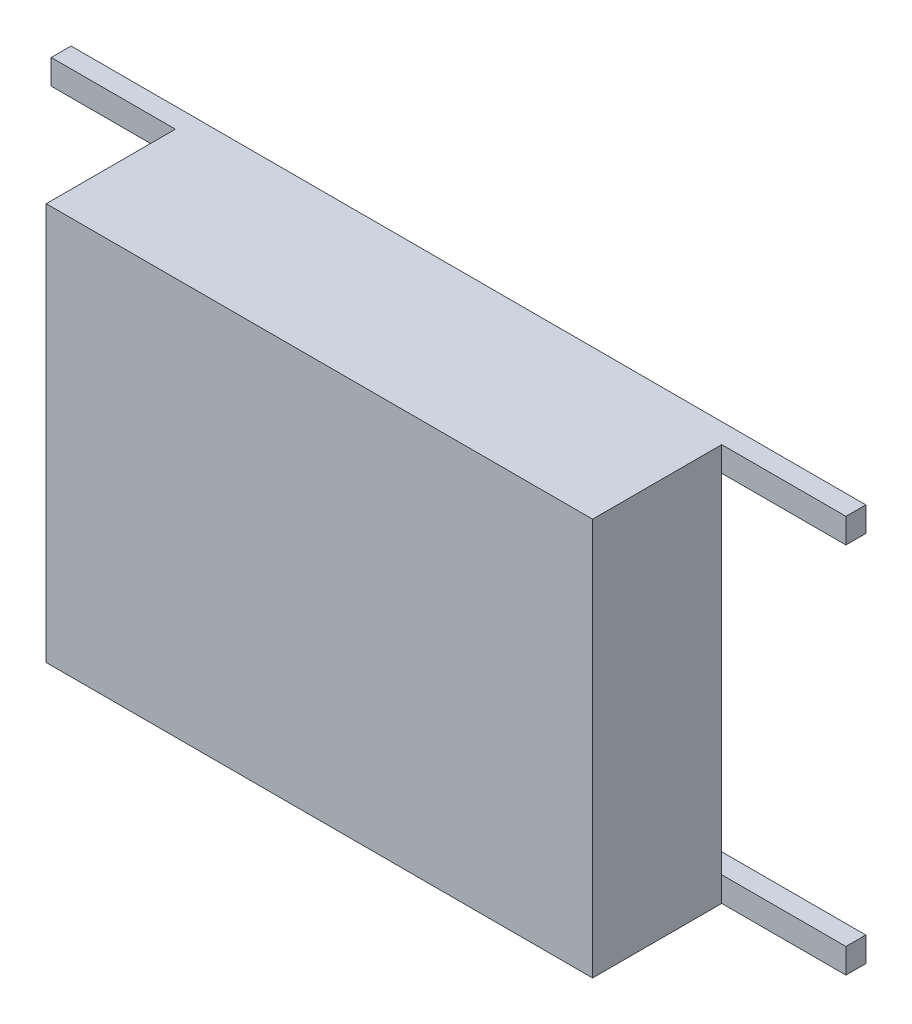
ISO-10303-21;
HEADER;
FILE_DESCRIPTION(('STEP AP214'),'2;1');
FILE_NAME('part.step','',(''),(''),'','','');
FILE_SCHEMA(('AUTOMOTIVE_DESIGN { 1 0 10303 214 1 1 1 1 }'));
ENDSEC;
DATA;
#1=APPLICATION_CONTEXT('core data for automotive mechanical design processes');
#2=APPLICATION_PROTOCOL_DEFINITION('international standard','automotive_design',2000,#1);
#3=PRODUCT_CONTEXT('',#1,'mechanical');
#4=PRODUCT('Part','Part','',(#3));
#5=PRODUCT_RELATED_PRODUCT_CATEGORY('part','',(#4));
#6=PRODUCT_DEFINITION_FORMATION('','',#4);
#7=PRODUCT_DEFINITION_CONTEXT('part definition',#1,'design');
#8=PRODUCT_DEFINITION('design','',#6,#7);
#9=PRODUCT_DEFINITION_SHAPE('','',#8);
#10=(LENGTH_UNIT() NAMED_UNIT(*) SI_UNIT(.MILLI.,.METRE.));
#11=(NAMED_UNIT(*) PLANE_ANGLE_UNIT() SI_UNIT($,.RADIAN.));
#12=(NAMED_UNIT(*) SI_UNIT($,.STERADIAN.) SOLID_ANGLE_UNIT());
#13=UNCERTAINTY_MEASURE_WITH_UNIT(LENGTH_MEASURE(1.E-05),#10,'distance_accuracy_value','');
#14=(GEOMETRIC_REPRESENTATION_CONTEXT(3) GLOBAL_UNCERTAINTY_ASSIGNED_CONTEXT((#13)) GLOBAL_UNIT_ASSIGNED_CONTEXT((#10,
#11,#12)) REPRESENTATION_CONTEXT('',''));
#15=CARTESIAN_POINT('',(0.,0.,0.));
#16=DIRECTION('',(0.,0.,1.));
#17=DIRECTION('',(1.,0.,0.));
#18=AXIS2_PLACEMENT_3D('',#15,#16,#17);
#19=CARTESIAN_POINT('',(0.15,-0.173205080757,0.02));
#20=DIRECTION('',(0.,0.,1.));
#21=DIRECTION('',(1.,0.,0.));
#22=AXIS2_PLACEMENT_3D('',#19,#20,#21);
#23=PLANE('',#22);
#24=DIRECTION('',(0.866025403784329,0.50000000000019,0.));
#25=VECTOR('',#24,1.);
#26=CARTESIAN_POINT('',(0.15,0.173205080757,0.02));
#27=LINE('',#26,#25);
#28=CARTESIAN_POINT('',(0.15,0.173205080757,0.02));
#29=VERTEX_POINT('',#28);
#30=CARTESIAN_POINT('',(-0.150000000000005,0.,0.02));
#31=VERTEX_POINT('',#30);
#32=EDGE_CURVE('E158',#29,#31,#27,.F.);
#33=ORIENTED_EDGE('',*,*,#32,.F.);
#34=DIRECTION('',(0.,1.,0.));
#35=VECTOR('',#34,1.);
#36=CARTESIAN_POINT('',(0.15,-0.173205080757,0.02));
#37=LINE('',#36,#35);
#38=CARTESIAN_POINT('',(0.150000000000003,-0.173205080756995,0.02));
#39=VERTEX_POINT('',#38);
#40=EDGE_CURVE('E162',#39,#29,#37,.T.);
#41=ORIENTED_EDGE('',*,*,#40,.F.);
#42=DIRECTION('',(-0.866025403784329,0.50000000000019,0.));
#43=VECTOR('',#42,1.);
#44=CARTESIAN_POINT('',(-0.15,0.,0.02));
#45=LINE('',#44,#43);
#46=EDGE_CURVE('E165',#31,#39,#45,.F.);
#47=ORIENTED_EDGE('',*,*,#46,.F.);
#48=EDGE_LOOP('',(#33,#41,#47));
#49=FACE_BOUND('',#48,.T.);
#50=ADVANCED_FACE('F17',(#49),#23,.F.);
#51=CARTESIAN_POINT('',(0.8,-0.35,0.04));
#52=DIRECTION('',(0.,-1.,0.));
#53=DIRECTION('',(1.,0.,0.));
#54=AXIS2_PLACEMENT_3D('',#51,#52,#53);
#55=PLANE('',#54);
#56=DIRECTION('',(0.,0.,1.));
#57=VECTOR('',#56,1.);
#58=CARTESIAN_POINT('',(0.35,-0.35,0.04));
#59=LINE('',#58,#57);
#60=CARTESIAN_POINT('',(0.35,-0.35,0.));
#61=VERTEX_POINT('',#60);
#62=CARTESIAN_POINT('',(0.35,-0.35,0.04));
#63=VERTEX_POINT('',#62);
#64=EDGE_CURVE('E20',#61,#63,#59,.T.);
#65=ORIENTED_EDGE('',*,*,#64,.T.);
#66=DIRECTION('',(-1.,0.,0.));
#67=VECTOR('',#66,1.);
#68=CARTESIAN_POINT('',(0.8,-0.35,0.04));
#69=LINE('',#68,#67);
#70=CARTESIAN_POINT('',(0.55,-0.35,0.04));
#71=VERTEX_POINT('',#70);
#72=EDGE_CURVE('E203',#71,#63,#69,.T.);
#73=ORIENTED_EDGE('',*,*,#72,.F.);
#74=DIRECTION('',(-1.,0.,0.));
#75=VECTOR('',#74,1.);
#76=CARTESIAN_POINT('',(0.8,-0.35,0.04));
#77=LINE('',#76,#75);
#78=CARTESIAN_POINT('',(0.8,-0.35,0.04));
#79=VERTEX_POINT('',#78);
#80=EDGE_CURVE('E196',#71,#79,#77,.F.);
#81=ORIENTED_EDGE('',*,*,#80,.T.);
#82=DIRECTION('',(0.,0.,1.));
#83=VECTOR('',#82,1.);
#84=CARTESIAN_POINT('',(0.8,-0.35,0.3));
#85=LINE('',#84,#83);
#86=CARTESIAN_POINT('',(0.8,-0.35,0.));
#87=VERTEX_POINT('',#86);
#88=EDGE_CURVE('E192',#79,#87,#85,.F.);
#89=ORIENTED_EDGE('',*,*,#88,.T.);
#90=DIRECTION('',(1.,0.,0.));
#91=VECTOR('',#90,1.);
#92=CARTESIAN_POINT('',(-0.8,-0.35,0.));
#93=LINE('',#92,#91);
#94=EDGE_CURVE('E216',#87,#61,#93,.F.);
#95=ORIENTED_EDGE('',*,*,#94,.T.);
#96=EDGE_LOOP('',(#65,#73,#81,#89,#95));
#97=FACE_BOUND('',#96,.T.);
#98=ADVANCED_FACE('F387',(#97),#55,.F.);
#99=CARTESIAN_POINT('',(0.35,-0.35,0.04));
#100=DIRECTION('',(-1.,0.,0.));
#101=DIRECTION('',(0.,0.,1.));
#102=AXIS2_PLACEMENT_3D('',#99,#100,#101);
#103=PLANE('',#102);
#104=DIRECTION('',(0.,0.,1.));
#105=VECTOR('',#104,1.);
#106=CARTESIAN_POINT('',(0.35,0.35,0.04));
#107=LINE('',#106,#105);
#108=CARTESIAN_POINT('',(0.35,0.35,0.));
#109=VERTEX_POINT('',#108);
#110=CARTESIAN_POINT('',(0.35,0.35,0.04));
#111=VERTEX_POINT('',#110);
#112=EDGE_CURVE('E184',#109,#111,#107,.T.);
#113=ORIENTED_EDGE('',*,*,#112,.T.);
#114=DIRECTION('',(0.,1.,0.));
#115=VECTOR('',#114,1.);
#116=CARTESIAN_POINT('',(0.35,-0.35,0.04));
#117=LINE('',#116,#115);
#118=EDGE_CURVE('E206',#63,#111,#117,.T.);
#119=ORIENTED_EDGE('',*,*,#118,.F.);
#120=ORIENTED_EDGE('',*,*,#64,.F.);
#121=DIRECTION('',(0.,1.,0.));
#122=VECTOR('',#121,1.);
#123=CARTESIAN_POINT('',(0.35,-0.4,0.));
#124=LINE('',#123,#122);
#125=EDGE_CURVE('E218',#61,#109,#124,.T.);
#126=ORIENTED_EDGE('',*,*,#125,.T.);
#127=EDGE_LOOP('',(#113,#119,#120,#126));
#128=FACE_BOUND('',#127,.T.);
#129=ADVANCED_FACE('F386',(#128),#103,.F.);
#130=CARTESIAN_POINT('',(0.15,0.173205080757,0.02));
#131=DIRECTION('',(0.50000000000019,-0.866025403784329,0.));
#132=DIRECTION('',(0.866025403784329,0.50000000000019,0.));
#133=AXIS2_PLACEMENT_3D('',#130,#131,#132);
#134=PLANE('',#133);
#135=ORIENTED_EDGE('',*,*,#32,.T.);
#136=DIRECTION('',(0.,0.,1.));
#137=VECTOR('',#136,1.);
#138=CARTESIAN_POINT('',(-0.15,0.,0.02));
#139=LINE('',#138,#137);
#140=CARTESIAN_POINT('',(-0.150000000000005,0.,0.));
#141=VERTEX_POINT('',#140);
#142=EDGE_CURVE('E174',#141,#31,#139,.T.);
#143=ORIENTED_EDGE('',*,*,#142,.F.);
#144=DIRECTION('',(0.866025403784298,0.500000000000243,0.));
#145=VECTOR('',#144,1.);
#146=CARTESIAN_POINT('',(-0.15,0.,0.));
#147=LINE('',#146,#145);
#148=CARTESIAN_POINT('',(0.15,0.173205080757,0.));
#149=VERTEX_POINT('',#148);
#150=EDGE_CURVE('E171',#141,#149,#147,.T.);
#151=ORIENTED_EDGE('',*,*,#150,.T.);
#152=DIRECTION('',(0.,0.,1.));
#153=VECTOR('',#152,1.);
#154=CARTESIAN_POINT('',(0.15,0.173205080757,0.02));
#155=LINE('',#154,#153);
#156=EDGE_CURVE('E168',#29,#149,#155,.F.);
#157=ORIENTED_EDGE('',*,*,#156,.F.);
#158=EDGE_LOOP('',(#135,#143,#151,#157));
#159=FACE_BOUND('',#158,.T.);
#160=ADVANCED_FACE('F169',(#159),#134,.T.);
#161=CARTESIAN_POINT('',(0.15,-0.173205080757,0.02));
#162=DIRECTION('',(-1.,0.,0.));
#163=DIRECTION('',(0.,0.,1.));
#164=AXIS2_PLACEMENT_3D('',#161,#162,#163);
#165=PLANE('',#164);
#166=ORIENTED_EDGE('',*,*,#40,.T.);
#167=ORIENTED_EDGE('',*,*,#156,.T.);
#168=DIRECTION('',(0.,1.,0.));
#169=VECTOR('',#168,1.);
#170=CARTESIAN_POINT('',(0.15,-0.4,0.));
#171=LINE('',#170,#169);
#172=CARTESIAN_POINT('',(0.150000000000003,-0.173205080756995,0.));
#173=VERTEX_POINT('',#172);
#174=EDGE_CURVE('E234',#149,#173,#171,.F.);
#175=ORIENTED_EDGE('',*,*,#174,.T.);
#176=DIRECTION('',(0.,0.,1.));
#177=VECTOR('',#176,1.);
#178=CARTESIAN_POINT('',(0.150000000000011,-0.173205080756982,0.02));
#179=LINE('',#178,#177);
#180=EDGE_CURVE('E178',#39,#173,#179,.F.);
#181=ORIENTED_EDGE('',*,*,#180,.F.);
#182=EDGE_LOOP('',(#166,#167,#175,#181));
#183=FACE_BOUND('',#182,.T.);
#184=ADVANCED_FACE('F176',(#183),#165,.T.);
#185=CARTESIAN_POINT('',(-0.15,0.,0.02));
#186=DIRECTION('',(0.50000000000019,0.866025403784329,0.));
#187=DIRECTION('',(-0.866025403784329,0.50000000000019,0.));
#188=AXIS2_PLACEMENT_3D('',#185,#186,#187);
#189=PLANE('',#188);
#190=ORIENTED_EDGE('',*,*,#46,.T.);
#191=ORIENTED_EDGE('',*,*,#180,.T.);
#192=DIRECTION('',(-0.866025403784298,0.500000000000243,0.));
#193=VECTOR('',#192,1.);
#194=CARTESIAN_POINT('',(0.15,-0.173205080757,0.));
#195=LINE('',#194,#193);
#196=EDGE_CURVE('E236',#173,#141,#195,.T.);
#197=ORIENTED_EDGE('',*,*,#196,.T.);
#198=ORIENTED_EDGE('',*,*,#142,.T.);
#199=EDGE_LOOP('',(#190,#191,#197,#198));
#200=FACE_BOUND('',#199,.T.);
#201=ADVANCED_FACE('F564',(#200),#189,.T.);
#202=CARTESIAN_POINT('',(0.35,0.35,0.04));
#203=DIRECTION('',(0.,1.,0.));
#204=DIRECTION('',(-1.,0.,0.));
#205=AXIS2_PLACEMENT_3D('',#202,#203,#204);
#206=PLANE('',#205);
#207=DIRECTION('',(0.,0.,1.));
#208=VECTOR('',#207,1.);
#209=CARTESIAN_POINT('',(0.8,0.35,0.3));
#210=LINE('',#209,#208);
#211=CARTESIAN_POINT('',(0.8,0.35,0.));
#212=VERTEX_POINT('',#211);
#213=CARTESIAN_POINT('',(0.8,0.35,0.04));
#214=VERTEX_POINT('',#213);
#215=EDGE_CURVE('E242',#212,#214,#210,.T.);
#216=ORIENTED_EDGE('',*,*,#215,.T.);
#217=DIRECTION('',(-1.,0.,0.));
#218=VECTOR('',#217,1.);
#219=CARTESIAN_POINT('',(0.8,0.35,0.04));
#220=LINE('',#219,#218);
#221=CARTESIAN_POINT('',(0.55,0.35,0.04));
#222=VERTEX_POINT('',#221);
#223=EDGE_CURVE('E244',#214,#222,#220,.T.);
#224=ORIENTED_EDGE('',*,*,#223,.T.);
#225=DIRECTION('',(-1.,0.,0.));
#226=VECTOR('',#225,1.);
#227=CARTESIAN_POINT('',(0.8,0.35,0.04));
#228=LINE('',#227,#226);
#229=EDGE_CURVE('E200',#111,#222,#228,.F.);
#230=ORIENTED_EDGE('',*,*,#229,.F.);
#231=ORIENTED_EDGE('',*,*,#112,.F.);
#232=DIRECTION('',(1.,0.,0.));
#233=VECTOR('',#232,1.);
#234=CARTESIAN_POINT('',(-0.8,0.35,0.));
#235=LINE('',#234,#233);
#236=EDGE_CURVE('E220',#109,#212,#235,.T.);
#237=ORIENTED_EDGE('',*,*,#236,.T.);
#238=EDGE_LOOP('',(#216,#224,#230,#231,#237));
#239=FACE_BOUND('',#238,.T.);
#240=ADVANCED_FACE('F380',(#239),#206,.F.);
#241=CARTESIAN_POINT('',(-0.35,-0.35,0.04));
#242=DIRECTION('',(-1.,0.,0.));
#243=DIRECTION('',(0.,0.,1.));
#244=AXIS2_PLACEMENT_3D('',#241,#242,#243);
#245=PLANE('',#244);
#246=DIRECTION('',(0.,1.,0.));
#247=VECTOR('',#246,1.);
#248=CARTESIAN_POINT('',(-0.35,-0.35,0.04));
#249=LINE('',#248,#247);
#250=CARTESIAN_POINT('',(-0.35,-0.35,0.04));
#251=VERTEX_POINT('',#250);
#252=CARTESIAN_POINT('',(-0.35,0.35,0.04));
#253=VERTEX_POINT('',#252);
#254=EDGE_CURVE('E255',#251,#253,#249,.T.);
#255=ORIENTED_EDGE('',*,*,#254,.T.);
#256=DIRECTION('',(0.,0.,-1.));
#257=VECTOR('',#256,1.);
#258=CARTESIAN_POINT('',(-0.35,0.35,0.04));
#259=LINE('',#258,#257);
#260=CARTESIAN_POINT('',(-0.35,0.35,0.));
#261=VERTEX_POINT('',#260);
#262=EDGE_CURVE('E189',#261,#253,#259,.F.);
#263=ORIENTED_EDGE('',*,*,#262,.F.);
#264=DIRECTION('',(0.,1.,0.));
#265=VECTOR('',#264,1.);
#266=CARTESIAN_POINT('',(-0.35,-0.4,0.));
#267=LINE('',#266,#265);
#268=CARTESIAN_POINT('',(-0.35,-0.35,0.));
#269=VERTEX_POINT('',#268);
#270=EDGE_CURVE('E228',#261,#269,#267,.F.);
#271=ORIENTED_EDGE('',*,*,#270,.T.);
#272=DIRECTION('',(0.,0.,1.));
#273=VECTOR('',#272,1.);
#274=CARTESIAN_POINT('',(-0.35,-0.35,0.04));
#275=LINE('',#274,#273);
#276=EDGE_CURVE('E186',#251,#269,#275,.F.);
#277=ORIENTED_EDGE('',*,*,#276,.F.);
#278=EDGE_LOOP('',(#255,#263,#271,#277));
#279=FACE_BOUND('',#278,.T.);
#280=ADVANCED_FACE('F403',(#279),#245,.T.);
#281=CARTESIAN_POINT('',(-0.8,-0.35,0.04));
#282=DIRECTION('',(0.,1.,0.));
#283=DIRECTION('',(0.,0.,1.));
#284=AXIS2_PLACEMENT_3D('',#281,#282,#283);
#285=PLANE('',#284);
#286=DIRECTION('',(1.,0.,0.));
#287=VECTOR('',#286,1.);
#288=CARTESIAN_POINT('',(-0.8,-0.35,0.04));
#289=LINE('',#288,#287);
#290=CARTESIAN_POINT('',(-0.55,-0.35,0.04));
#291=VERTEX_POINT('',#290);
#292=EDGE_CURVE('E259',#291,#251,#289,.T.);
#293=ORIENTED_EDGE('',*,*,#292,.T.);
#294=ORIENTED_EDGE('',*,*,#276,.T.);
#295=DIRECTION('',(1.,0.,0.));
#296=VECTOR('',#295,1.);
#297=CARTESIAN_POINT('',(-0.8,-0.35,0.));
#298=LINE('',#297,#296);
#299=CARTESIAN_POINT('',(-0.8,-0.35,0.));
#300=VERTEX_POINT('',#299);
#301=EDGE_CURVE('E230',#269,#300,#298,.F.);
#302=ORIENTED_EDGE('',*,*,#301,.T.);
#303=DIRECTION('',(0.,0.,-1.));
#304=VECTOR('',#303,1.);
#305=CARTESIAN_POINT('',(-0.8,-0.35,0.3));
#306=LINE('',#305,#304);
#307=CARTESIAN_POINT('',(-0.8,-0.35,0.04));
#308=VERTEX_POINT('',#307);
#309=EDGE_CURVE('E194',#300,#308,#306,.F.);
#310=ORIENTED_EDGE('',*,*,#309,.T.);
#311=DIRECTION('',(1.,0.,0.));
#312=VECTOR('',#311,1.);
#313=CARTESIAN_POINT('',(-0.8,-0.35,0.04));
#314=LINE('',#313,#312);
#315=EDGE_CURVE('E252',#291,#308,#314,.F.);
#316=ORIENTED_EDGE('',*,*,#315,.F.);
#317=EDGE_LOOP('',(#293,#294,#302,#310,#316));
#318=FACE_BOUND('',#317,.T.);
#319=ADVANCED_FACE('F399',(#318),#285,.T.);
#320=CARTESIAN_POINT('',(-0.35,0.35,0.04));
#321=DIRECTION('',(0.,-1.,0.));
#322=DIRECTION('',(0.,0.,-1.));
#323=AXIS2_PLACEMENT_3D('',#320,#321,#322);
#324=PLANE('',#323);
#325=DIRECTION('',(1.,0.,0.));
#326=VECTOR('',#325,1.);
#327=CARTESIAN_POINT('',(-0.8,0.35,0.04));
#328=LINE('',#327,#326);
#329=CARTESIAN_POINT('',(-0.8,0.35,0.04));
#330=VERTEX_POINT('',#329);
#331=CARTESIAN_POINT('',(-0.55,0.35,0.04));
#332=VERTEX_POINT('',#331);
#333=EDGE_CURVE('E265',#330,#332,#328,.T.);
#334=ORIENTED_EDGE('',*,*,#333,.F.);
#335=DIRECTION('',(0.,0.,-1.));
#336=VECTOR('',#335,1.);
#337=CARTESIAN_POINT('',(-0.8,0.35,0.3));
#338=LINE('',#337,#336);
#339=CARTESIAN_POINT('',(-0.8,0.35,0.));
#340=VERTEX_POINT('',#339);
#341=EDGE_CURVE('E209',#330,#340,#338,.T.);
#342=ORIENTED_EDGE('',*,*,#341,.T.);
#343=DIRECTION('',(1.,0.,0.));
#344=VECTOR('',#343,1.);
#345=CARTESIAN_POINT('',(-0.8,0.35,0.));
#346=LINE('',#345,#344);
#347=EDGE_CURVE('E225',#340,#261,#346,.T.);
#348=ORIENTED_EDGE('',*,*,#347,.T.);
#349=ORIENTED_EDGE('',*,*,#262,.T.);
#350=DIRECTION('',(1.,0.,0.));
#351=VECTOR('',#350,1.);
#352=CARTESIAN_POINT('',(-0.8,0.35,0.04));
#353=LINE('',#352,#351);
#354=EDGE_CURVE('E257',#253,#332,#353,.F.);
#355=ORIENTED_EDGE('',*,*,#354,.T.);
#356=EDGE_LOOP('',(#334,#342,#348,#349,#355));
#357=FACE_BOUND('',#356,.T.);
#358=ADVANCED_FACE('F406',(#357),#324,.T.);
#359=CARTESIAN_POINT('',(0.8,-0.4,0.3));
#360=DIRECTION('',(-1.,0.,0.));
#361=DIRECTION('',(0.,0.,1.));
#362=AXIS2_PLACEMENT_3D('',#359,#360,#361);
#363=PLANE('',#362);
#364=DIRECTION('',(0.,1.,0.));
#365=VECTOR('',#364,1.);
#366=CARTESIAN_POINT('',(0.8,-0.4,0.04));
#367=LINE('',#366,#365);
#368=CARTESIAN_POINT('',(0.8,-0.4,0.04));
#369=VERTEX_POINT('',#368);
#370=EDGE_CURVE('E198',#79,#369,#367,.F.);
#371=ORIENTED_EDGE('',*,*,#370,.T.);
#372=DIRECTION('',(0.,0.,1.));
#373=VECTOR('',#372,1.);
#374=CARTESIAN_POINT('',(0.8,-0.4,0.3));
#375=LINE('',#374,#373);
#376=CARTESIAN_POINT('',(0.8,-0.4,0.));
#377=VERTEX_POINT('',#376);
#378=EDGE_CURVE('E271',#369,#377,#375,.F.);
#379=ORIENTED_EDGE('',*,*,#378,.T.);
#380=DIRECTION('',(0.,1.,0.));
#381=VECTOR('',#380,1.);
#382=CARTESIAN_POINT('',(0.8,-0.4,0.));
#383=LINE('',#382,#381);
#384=EDGE_CURVE('E213',#377,#87,#383,.T.);
#385=ORIENTED_EDGE('',*,*,#384,.T.);
#386=ORIENTED_EDGE('',*,*,#88,.F.);
#387=EDGE_LOOP('',(#371,#379,#385,#386));
#388=FACE_BOUND('',#387,.T.);
#389=ADVANCED_FACE('F389',(#388),#363,.F.);
#390=CARTESIAN_POINT('',(-0.8,0.4,0.3));
#391=DIRECTION('',(1.,0.,0.));
#392=DIRECTION('',(0.,0.,-1.));
#393=AXIS2_PLACEMENT_3D('',#390,#391,#392);
#394=PLANE('',#393);
#395=ORIENTED_EDGE('',*,*,#309,.F.);
#396=DIRECTION('',(0.,1.,0.));
#397=VECTOR('',#396,1.);
#398=CARTESIAN_POINT('',(-0.8,-0.4,0.));
#399=LINE('',#398,#397);
#400=CARTESIAN_POINT('',(-0.8,-0.4,0.));
#401=VERTEX_POINT('',#400);
#402=EDGE_CURVE('E211',#300,#401,#399,.F.);
#403=ORIENTED_EDGE('',*,*,#402,.T.);
#404=DIRECTION('',(0.,0.,1.));
#405=VECTOR('',#404,1.);
#406=CARTESIAN_POINT('',(-0.8,-0.4,0.3));
#407=LINE('',#406,#405);
#408=CARTESIAN_POINT('',(-0.8,-0.4,0.04));
#409=VERTEX_POINT('',#408);
#410=EDGE_CURVE('E276',#401,#409,#407,.T.);
#411=ORIENTED_EDGE('',*,*,#410,.T.);
#412=DIRECTION('',(0.,1.,0.));
#413=VECTOR('',#412,1.);
#414=CARTESIAN_POINT('',(-0.8,-0.4,0.04));
#415=LINE('',#414,#413);
#416=EDGE_CURVE('E249',#308,#409,#415,.F.);
#417=ORIENTED_EDGE('',*,*,#416,.F.);
#418=EDGE_LOOP('',(#395,#403,#411,#417));
#419=FACE_BOUND('',#418,.T.);
#420=ADVANCED_FACE('F394',(#419),#394,.F.);
#421=CARTESIAN_POINT('',(0.8,-0.4,0.04));
#422=DIRECTION('',(0.,0.,-1.));
#423=DIRECTION('',(-1.,0.,0.));
#424=AXIS2_PLACEMENT_3D('',#421,#422,#423);
#425=PLANE('',#424);
#426=DIRECTION('',(-1.,0.,0.));
#427=VECTOR('',#426,1.);
#428=CARTESIAN_POINT('',(-0.8,-0.4,0.04));
#429=LINE('',#428,#427);
#430=CARTESIAN_POINT('',(0.55,-0.4,0.04));
#431=VERTEX_POINT('',#430);
#432=EDGE_CURVE('E268',#431,#369,#429,.F.);
#433=ORIENTED_EDGE('',*,*,#432,.T.);
#434=ORIENTED_EDGE('',*,*,#370,.F.);
#435=ORIENTED_EDGE('',*,*,#80,.F.);
#436=DIRECTION('',(0.,1.,0.));
#437=VECTOR('',#436,1.);
#438=CARTESIAN_POINT('',(0.55,-0.4,0.04));
#439=LINE('',#438,#437);
#440=EDGE_CURVE('E283',#431,#71,#439,.T.);
#441=ORIENTED_EDGE('',*,*,#440,.F.);
#442=EDGE_LOOP('',(#433,#434,#435,#441));
#443=FACE_BOUND('',#442,.T.);
#444=ADVANCED_FACE('F370',(#443),#425,.F.);
#445=CARTESIAN_POINT('',(0.8,-0.35,0.04));
#446=DIRECTION('',(0.,0.,-1.));
#447=DIRECTION('',(-1.,0.,0.));
#448=AXIS2_PLACEMENT_3D('',#445,#446,#447);
#449=PLANE('',#448);
#450=ORIENTED_EDGE('',*,*,#72,.T.);
#451=ORIENTED_EDGE('',*,*,#118,.T.);
#452=ORIENTED_EDGE('',*,*,#229,.T.);
#453=DIRECTION('',(0.,1.,0.));
#454=VECTOR('',#453,1.);
#455=CARTESIAN_POINT('',(0.55,-0.4,0.04));
#456=LINE('',#455,#454);
#457=EDGE_CURVE('E286',#71,#222,#456,.T.);
#458=ORIENTED_EDGE('',*,*,#457,.F.);
#459=EDGE_LOOP('',(#450,#451,#452,#458));
#460=FACE_BOUND('',#459,.T.);
#461=ADVANCED_FACE('F375',(#460),#449,.T.);
#462=CARTESIAN_POINT('',(-0.8,0.4,0.3));
#463=DIRECTION('',(1.,0.,0.));
#464=DIRECTION('',(0.,0.,-1.));
#465=AXIS2_PLACEMENT_3D('',#462,#463,#464);
#466=PLANE('',#465);
#467=DIRECTION('',(0.,0.,1.));
#468=VECTOR('',#467,1.);
#469=CARTESIAN_POINT('',(-0.8,0.4,0.3));
#470=LINE('',#469,#468);
#471=CARTESIAN_POINT('',(-0.8,0.4,0.04));
#472=VERTEX_POINT('',#471);
#473=CARTESIAN_POINT('',(-0.8,0.4,0.));
#474=VERTEX_POINT('',#473);
#475=EDGE_CURVE('E295',#472,#474,#470,.F.);
#476=ORIENTED_EDGE('',*,*,#475,.T.);
#477=DIRECTION('',(0.,1.,0.));
#478=VECTOR('',#477,1.);
#479=CARTESIAN_POINT('',(-0.8,-0.4,0.));
#480=LINE('',#479,#478);
#481=EDGE_CURVE('E222',#474,#340,#480,.F.);
#482=ORIENTED_EDGE('',*,*,#481,.T.);
#483=ORIENTED_EDGE('',*,*,#341,.F.);
#484=DIRECTION('',(0.,1.,0.));
#485=VECTOR('',#484,1.);
#486=CARTESIAN_POINT('',(-0.8,-0.4,0.04));
#487=LINE('',#486,#485);
#488=EDGE_CURVE('E262',#472,#330,#487,.F.);
#489=ORIENTED_EDGE('',*,*,#488,.F.);
#490=EDGE_LOOP('',(#476,#482,#483,#489));
#491=FACE_BOUND('',#490,.T.);
#492=ADVANCED_FACE('F352',(#491),#466,.F.);
#493=CARTESIAN_POINT('',(-0.8,-0.4,0.));
#494=DIRECTION('',(0.,0.,1.));
#495=DIRECTION('',(1.,0.,0.));
#496=AXIS2_PLACEMENT_3D('',#493,#494,#495);
#497=PLANE('',#496);
#498=ORIENTED_EDGE('',*,*,#174,.F.);
#499=ORIENTED_EDGE('',*,*,#150,.F.);
#500=ORIENTED_EDGE('',*,*,#196,.F.);
#501=EDGE_LOOP('',(#498,#499,#500));
#502=FACE_BOUND('',#501,.T.);
#503=ORIENTED_EDGE('',*,*,#270,.F.);
#504=ORIENTED_EDGE('',*,*,#347,.F.);
#505=ORIENTED_EDGE('',*,*,#481,.F.);
#506=DIRECTION('',(1.,0.,0.));
#507=VECTOR('',#506,1.);
#508=CARTESIAN_POINT('',(0.8,0.4,0.));
#509=LINE('',#508,#507);
#510=CARTESIAN_POINT('',(0.8,0.4,0.));
#511=VERTEX_POINT('',#510);
#512=EDGE_CURVE('E297',#474,#511,#509,.T.);
#513=ORIENTED_EDGE('',*,*,#512,.T.);
#514=DIRECTION('',(0.,1.,0.));
#515=VECTOR('',#514,1.);
#516=CARTESIAN_POINT('',(0.8,-0.4,0.));
#517=LINE('',#516,#515);
#518=EDGE_CURVE('E239',#511,#212,#517,.F.);
#519=ORIENTED_EDGE('',*,*,#518,.T.);
#520=ORIENTED_EDGE('',*,*,#236,.F.);
#521=ORIENTED_EDGE('',*,*,#125,.F.);
#522=ORIENTED_EDGE('',*,*,#94,.F.);
#523=ORIENTED_EDGE('',*,*,#384,.F.);
#524=DIRECTION('',(-1.,0.,0.));
#525=VECTOR('',#524,1.);
#526=CARTESIAN_POINT('',(-0.8,-0.4,0.));
#527=LINE('',#526,#525);
#528=EDGE_CURVE('E273',#377,#401,#527,.T.);
#529=ORIENTED_EDGE('',*,*,#528,.T.);
#530=ORIENTED_EDGE('',*,*,#402,.F.);
#531=ORIENTED_EDGE('',*,*,#301,.F.);
#532=EDGE_LOOP('',(#503,#504,#505,#513,#519,#520,#521,#522,#523,#529,#530,#531));
#533=FACE_BOUND('',#532,.T.);
#534=ADVANCED_FACE('F348',(#502,#533),#497,.F.);
#535=CARTESIAN_POINT('',(0.8,-0.4,0.3));
#536=DIRECTION('',(-1.,0.,0.));
#537=DIRECTION('',(0.,0.,1.));
#538=AXIS2_PLACEMENT_3D('',#535,#536,#537);
#539=PLANE('',#538);
#540=DIRECTION('',(0.,1.,0.));
#541=VECTOR('',#540,1.);
#542=CARTESIAN_POINT('',(0.8,-0.4,0.04));
#543=LINE('',#542,#541);
#544=CARTESIAN_POINT('',(0.8,0.4,0.04));
#545=VERTEX_POINT('',#544);
#546=EDGE_CURVE('E246',#545,#214,#543,.F.);
#547=ORIENTED_EDGE('',*,*,#546,.T.);
#548=ORIENTED_EDGE('',*,*,#215,.F.);
#549=ORIENTED_EDGE('',*,*,#518,.F.);
#550=DIRECTION('',(0.,0.,1.));
#551=VECTOR('',#550,1.);
#552=CARTESIAN_POINT('',(0.8,0.4,0.3));
#553=LINE('',#552,#551);
#554=EDGE_CURVE('E299',#511,#545,#553,.T.);
#555=ORIENTED_EDGE('',*,*,#554,.T.);
#556=EDGE_LOOP('',(#547,#548,#549,#555));
#557=FACE_BOUND('',#556,.T.);
#558=ADVANCED_FACE('F341',(#557),#539,.F.);
#559=CARTESIAN_POINT('',(0.8,-0.4,0.04));
#560=DIRECTION('',(0.,0.,-1.));
#561=DIRECTION('',(-1.,0.,0.));
#562=AXIS2_PLACEMENT_3D('',#559,#560,#561);
#563=PLANE('',#562);
#564=DIRECTION('',(1.,0.,0.));
#565=VECTOR('',#564,1.);
#566=CARTESIAN_POINT('',(0.8,0.4,0.04));
#567=LINE('',#566,#565);
#568=CARTESIAN_POINT('',(0.55,0.4,0.04));
#569=VERTEX_POINT('',#568);
#570=EDGE_CURVE('E301',#545,#569,#567,.F.);
#571=ORIENTED_EDGE('',*,*,#570,.T.);
#572=DIRECTION('',(0.,1.,0.));
#573=VECTOR('',#572,1.);
#574=CARTESIAN_POINT('',(0.55,-0.4,0.04));
#575=LINE('',#574,#573);
#576=EDGE_CURVE('E289',#222,#569,#575,.T.);
#577=ORIENTED_EDGE('',*,*,#576,.F.);
#578=ORIENTED_EDGE('',*,*,#223,.F.);
#579=ORIENTED_EDGE('',*,*,#546,.F.);
#580=EDGE_LOOP('',(#571,#577,#578,#579));
#581=FACE_BOUND('',#580,.T.);
#582=ADVANCED_FACE('F337',(#581),#563,.F.);
#583=CARTESIAN_POINT('',(-0.8,-0.4,0.04));
#584=DIRECTION('',(0.,0.,1.));
#585=DIRECTION('',(1.,0.,0.));
#586=AXIS2_PLACEMENT_3D('',#583,#584,#585);
#587=PLANE('',#586);
#588=DIRECTION('',(0.,1.,0.));
#589=VECTOR('',#588,1.);
#590=CARTESIAN_POINT('',(-0.55,-0.4,0.04));
#591=LINE('',#590,#589);
#592=CARTESIAN_POINT('',(-0.55,-0.4,0.04));
#593=VERTEX_POINT('',#592);
#594=EDGE_CURVE('E308',#593,#291,#591,.T.);
#595=ORIENTED_EDGE('',*,*,#594,.T.);
#596=ORIENTED_EDGE('',*,*,#315,.T.);
#597=ORIENTED_EDGE('',*,*,#416,.T.);
#598=DIRECTION('',(-1.,0.,0.));
#599=VECTOR('',#598,1.);
#600=CARTESIAN_POINT('',(-0.8,-0.4,0.04));
#601=LINE('',#600,#599);
#602=EDGE_CURVE('E278',#409,#593,#601,.F.);
#603=ORIENTED_EDGE('',*,*,#602,.T.);
#604=EDGE_LOOP('',(#595,#596,#597,#603));
#605=FACE_BOUND('',#604,.T.);
#606=ADVANCED_FACE('F396',(#605),#587,.T.);
#607=CARTESIAN_POINT('',(-0.8,-0.35,0.04));
#608=DIRECTION('',(0.,0.,1.));
#609=DIRECTION('',(1.,0.,0.));
#610=AXIS2_PLACEMENT_3D('',#607,#608,#609);
#611=PLANE('',#610);
#612=DIRECTION('',(0.,1.,0.));
#613=VECTOR('',#612,1.);
#614=CARTESIAN_POINT('',(-0.55,-0.4,0.04));
#615=LINE('',#614,#613);
#616=EDGE_CURVE('E311',#291,#332,#615,.T.);
#617=ORIENTED_EDGE('',*,*,#616,.T.);
#618=ORIENTED_EDGE('',*,*,#354,.F.);
#619=ORIENTED_EDGE('',*,*,#254,.F.);
#620=ORIENTED_EDGE('',*,*,#292,.F.);
#621=EDGE_LOOP('',(#617,#618,#619,#620));
#622=FACE_BOUND('',#621,.T.);
#623=ADVANCED_FACE('F408',(#622),#611,.F.);
#624=CARTESIAN_POINT('',(-0.8,-0.4,0.04));
#625=DIRECTION('',(0.,0.,1.));
#626=DIRECTION('',(1.,0.,0.));
#627=AXIS2_PLACEMENT_3D('',#624,#625,#626);
#628=PLANE('',#627);
#629=ORIENTED_EDGE('',*,*,#488,.T.);
#630=ORIENTED_EDGE('',*,*,#333,.T.);
#631=DIRECTION('',(0.,1.,0.));
#632=VECTOR('',#631,1.);
#633=CARTESIAN_POINT('',(-0.55,-0.4,0.04));
#634=LINE('',#633,#632);
#635=CARTESIAN_POINT('',(-0.55,0.4,0.04));
#636=VERTEX_POINT('',#635);
#637=EDGE_CURVE('E314',#332,#636,#634,.T.);
#638=ORIENTED_EDGE('',*,*,#637,.T.);
#639=DIRECTION('',(1.,0.,0.));
#640=VECTOR('',#639,1.);
#641=CARTESIAN_POINT('',(0.8,0.4,0.04));
#642=LINE('',#641,#640);
#643=EDGE_CURVE('E292',#636,#472,#642,.F.);
#644=ORIENTED_EDGE('',*,*,#643,.T.);
#645=EDGE_LOOP('',(#629,#630,#638,#644));
#646=FACE_BOUND('',#645,.T.);
#647=ADVANCED_FACE('F355',(#646),#628,.T.);
#648=CARTESIAN_POINT('',(-0.8,-0.4,0.3));
#649=DIRECTION('',(0.,1.,0.));
#650=DIRECTION('',(-1.,0.,0.));
#651=AXIS2_PLACEMENT_3D('',#648,#649,#650);
#652=PLANE('',#651);
#653=DIRECTION('',(1.,0.,0.));
#654=VECTOR('',#653,1.);
#655=CARTESIAN_POINT('',(-0.8,-0.4,0.3));
#656=LINE('',#655,#654);
#657=CARTESIAN_POINT('',(-0.55,-0.4,0.3));
#658=VERTEX_POINT('',#657);
#659=CARTESIAN_POINT('',(0.55,-0.4,0.3));
#660=VERTEX_POINT('',#659);
#661=EDGE_CURVE('E317',#658,#660,#656,.T.);
#662=ORIENTED_EDGE('',*,*,#661,.F.);
#663=DIRECTION('',(0.,0.,1.));
#664=VECTOR('',#663,1.);
#665=CARTESIAN_POINT('',(-0.55,-0.4,0.04));
#666=LINE('',#665,#664);
#667=EDGE_CURVE('E305',#658,#593,#666,.F.);
#668=ORIENTED_EDGE('',*,*,#667,.T.);
#669=ORIENTED_EDGE('',*,*,#602,.F.);
#670=ORIENTED_EDGE('',*,*,#410,.F.);
#671=ORIENTED_EDGE('',*,*,#528,.F.);
#672=ORIENTED_EDGE('',*,*,#378,.F.);
#673=ORIENTED_EDGE('',*,*,#432,.F.);
#674=DIRECTION('',(0.,0.,1.));
#675=VECTOR('',#674,1.);
#676=CARTESIAN_POINT('',(0.55,-0.4,0.04));
#677=LINE('',#676,#675);
#678=EDGE_CURVE('E280',#660,#431,#677,.F.);
#679=ORIENTED_EDGE('',*,*,#678,.F.);
#680=EDGE_LOOP('',(#662,#668,#669,#670,#671,#672,#673,#679));
#681=FACE_BOUND('',#680,.T.);
#682=ADVANCED_FACE('F364',(#681),#652,.F.);
#683=CARTESIAN_POINT('',(0.55,-0.4,0.04));
#684=DIRECTION('',(1.,0.,0.));
#685=DIRECTION('',(0.,1.,0.));
#686=AXIS2_PLACEMENT_3D('',#683,#684,#685);
#687=PLANE('',#686);
#688=ORIENTED_EDGE('',*,*,#576,.T.);
#689=DIRECTION('',(0.,0.,1.));
#690=VECTOR('',#689,1.);
#691=CARTESIAN_POINT('',(0.55,0.4,0.3));
#692=LINE('',#691,#690);
#693=CARTESIAN_POINT('',(0.55,0.4,0.3));
#694=VERTEX_POINT('',#693);
#695=EDGE_CURVE('E303',#569,#694,#692,.T.);
#696=ORIENTED_EDGE('',*,*,#695,.T.);
#697=DIRECTION('',(0.,1.,0.));
#698=VECTOR('',#697,1.);
#699=CARTESIAN_POINT('',(0.55,-0.4,0.3));
#700=LINE('',#699,#698);
#701=EDGE_CURVE('E320',#660,#694,#700,.T.);
#702=ORIENTED_EDGE('',*,*,#701,.F.);
#703=ORIENTED_EDGE('',*,*,#678,.T.);
#704=ORIENTED_EDGE('',*,*,#440,.T.);
#705=ORIENTED_EDGE('',*,*,#457,.T.);
#706=EDGE_LOOP('',(#688,#696,#702,#703,#704,#705));
#707=FACE_BOUND('',#706,.T.);
#708=ADVANCED_FACE('F332',(#707),#687,.T.);
#709=CARTESIAN_POINT('',(0.8,0.4,0.3));
#710=DIRECTION('',(0.,-1.,0.));
#711=DIRECTION('',(1.,0.,0.));
#712=AXIS2_PLACEMENT_3D('',#709,#710,#711);
#713=PLANE('',#712);
#714=ORIENTED_EDGE('',*,*,#570,.F.);
#715=ORIENTED_EDGE('',*,*,#554,.F.);
#716=ORIENTED_EDGE('',*,*,#512,.F.);
#717=ORIENTED_EDGE('',*,*,#475,.F.);
#718=ORIENTED_EDGE('',*,*,#643,.F.);
#719=DIRECTION('',(0.,0.,1.));
#720=VECTOR('',#719,1.);
#721=CARTESIAN_POINT('',(-0.55,0.4,0.04));
#722=LINE('',#721,#720);
#723=CARTESIAN_POINT('',(-0.55,0.4,0.3));
#724=VERTEX_POINT('',#723);
#725=EDGE_CURVE('E35',#636,#724,#722,.T.);
#726=ORIENTED_EDGE('',*,*,#725,.T.);
#727=DIRECTION('',(1.,0.,0.));
#728=VECTOR('',#727,1.);
#729=CARTESIAN_POINT('',(-0.8,0.4,0.3));
#730=LINE('',#729,#728);
#731=EDGE_CURVE('E26',#694,#724,#730,.F.);
#732=ORIENTED_EDGE('',*,*,#731,.F.);
#733=ORIENTED_EDGE('',*,*,#695,.F.);
#734=EDGE_LOOP('',(#714,#715,#716,#717,#718,#726,#732,#733));
#735=FACE_BOUND('',#734,.T.);
#736=ADVANCED_FACE('F329',(#735),#713,.F.);
#737=CARTESIAN_POINT('',(-0.55,-0.4,0.04));
#738=DIRECTION('',(1.,0.,0.));
#739=DIRECTION('',(0.,1.,0.));
#740=AXIS2_PLACEMENT_3D('',#737,#738,#739);
#741=PLANE('',#740);
#742=ORIENTED_EDGE('',*,*,#725,.F.);
#743=ORIENTED_EDGE('',*,*,#637,.F.);
#744=ORIENTED_EDGE('',*,*,#616,.F.);
#745=ORIENTED_EDGE('',*,*,#594,.F.);
#746=ORIENTED_EDGE('',*,*,#667,.F.);
#747=DIRECTION('',(0.,1.,0.));
#748=VECTOR('',#747,1.);
#749=CARTESIAN_POINT('',(-0.55,-0.4,0.3));
#750=LINE('',#749,#748);
#751=EDGE_CURVE('E11',#724,#658,#750,.F.);
#752=ORIENTED_EDGE('',*,*,#751,.F.);
#753=EDGE_LOOP('',(#742,#743,#744,#745,#746,#752));
#754=FACE_BOUND('',#753,.T.);
#755=ADVANCED_FACE('F358',(#754),#741,.F.);
#756=CARTESIAN_POINT('',(-0.8,-0.4,0.3));
#757=DIRECTION('',(0.,0.,1.));
#758=DIRECTION('',(1.,0.,0.));
#759=AXIS2_PLACEMENT_3D('',#756,#757,#758);
#760=PLANE('',#759);
#761=ORIENTED_EDGE('',*,*,#731,.T.);
#762=ORIENTED_EDGE('',*,*,#751,.T.);
#763=ORIENTED_EDGE('',*,*,#661,.T.);
#764=ORIENTED_EDGE('',*,*,#701,.T.);
#765=EDGE_LOOP('',(#761,#762,#763,#764));
#766=FACE_BOUND('',#765,.T.);
#767=ADVANCED_FACE('F325',(#766),#760,.T.);
#768=CLOSED_SHELL('',(#50,#98,#129,#160,#184,#201,#240,#280,#319,#358,#389,#420,#444,#461,#492,
#534,#558,#582,#606,#623,#647,#682,#708,#736,#755,#767));
#769=MANIFOLD_SOLID_BREP('B1',#768);
#770=ADVANCED_BREP_SHAPE_REPRESENTATION('',(#18,#769),#14);
#771=SHAPE_DEFINITION_REPRESENTATION(#9,#770);
ENDSEC;
END-ISO-10303-21;
